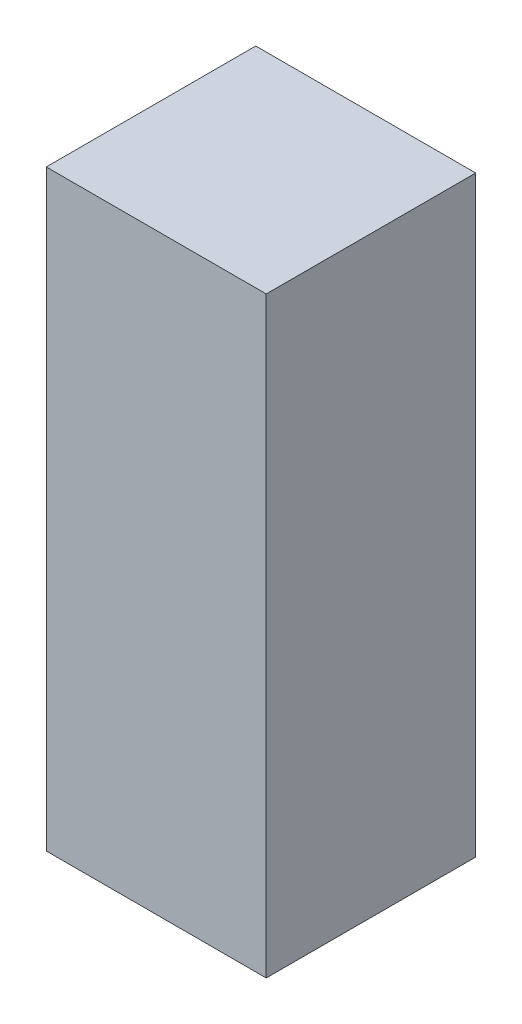
ISO-10303-21;
HEADER;
FILE_DESCRIPTION(('STEP AP214'),'2;1');
FILE_NAME('part.step','',(''),(''),'','','');
FILE_SCHEMA(('AUTOMOTIVE_DESIGN { 1 0 10303 214 1 1 1 1 }'));
ENDSEC;
DATA;
#1=APPLICATION_CONTEXT('core data for automotive mechanical design processes');
#2=APPLICATION_PROTOCOL_DEFINITION('international standard','automotive_design',2000,#1);
#3=PRODUCT_CONTEXT('',#1,'mechanical');
#4=PRODUCT('Part','Part','',(#3));
#5=PRODUCT_RELATED_PRODUCT_CATEGORY('part','',(#4));
#6=PRODUCT_DEFINITION_FORMATION('','',#4);
#7=PRODUCT_DEFINITION_CONTEXT('part definition',#1,'design');
#8=PRODUCT_DEFINITION('design','',#6,#7);
#9=PRODUCT_DEFINITION_SHAPE('','',#8);
#10=(LENGTH_UNIT() NAMED_UNIT(*) SI_UNIT(.MILLI.,.METRE.));
#11=(NAMED_UNIT(*) PLANE_ANGLE_UNIT() SI_UNIT($,.RADIAN.));
#12=(NAMED_UNIT(*) SI_UNIT($,.STERADIAN.) SOLID_ANGLE_UNIT());
#13=UNCERTAINTY_MEASURE_WITH_UNIT(LENGTH_MEASURE(1.E-05),#10,'distance_accuracy_value','');
#14=(GEOMETRIC_REPRESENTATION_CONTEXT(3) GLOBAL_UNCERTAINTY_ASSIGNED_CONTEXT((#13)) GLOBAL_UNIT_ASSIGNED_CONTEXT((#10,
#11,#12)) REPRESENTATION_CONTEXT('',''));
#15=CARTESIAN_POINT('',(0.,0.,0.));
#16=DIRECTION('',(0.,0.,1.));
#17=DIRECTION('',(1.,0.,0.));
#18=AXIS2_PLACEMENT_3D('',#15,#16,#17);
#19=CARTESIAN_POINT('',(7.76,0.982232995284,-6.999));
#20=DIRECTION('',(1.,0.,0.));
#21=DIRECTION('',(0.,-1.,0.));
#22=AXIS2_PLACEMENT_3D('',#19,#20,#21);
#23=PLANE('',#22);
#24=DIRECTION('',(0.,1.,0.));
#25=VECTOR('',#24,1.);
#26=CARTESIAN_POINT('',(7.76,0.415616497642,-7.));
#27=LINE('',#26,#25);
#28=CARTESIAN_POINT('',(7.76,-0.15,-7.));
#29=VERTEX_POINT('',#28);
#30=CARTESIAN_POINT('',(7.76,0.981232995284,-7.));
#31=VERTEX_POINT('',#30);
#32=EDGE_CURVE('E69',#29,#31,#27,.T.);
#33=ORIENTED_EDGE('',*,*,#32,.F.);
#34=DIRECTION('',(0.,0.,1.));
#35=VECTOR('',#34,1.);
#36=CARTESIAN_POINT('',(7.76,-0.15,-7.2));
#37=LINE('',#36,#35);
#38=CARTESIAN_POINT('',(7.76,-0.15,-7.4));
#39=VERTEX_POINT('',#38);
#40=EDGE_CURVE('E56',#39,#29,#37,.T.);
#41=ORIENTED_EDGE('',*,*,#40,.F.);
#42=DIRECTION('',(0.,-1.,0.));
#43=VECTOR('',#42,1.);
#44=CARTESIAN_POINT('',(7.76,0.415616497642,-7.4));
#45=LINE('',#44,#43);
#46=CARTESIAN_POINT('',(7.76,0.981232995284,-7.4));
#47=VERTEX_POINT('',#46);
#48=EDGE_CURVE('E21',#47,#39,#45,.T.);
#49=ORIENTED_EDGE('',*,*,#48,.F.);
#50=DIRECTION('',(0.,0.,-1.));
#51=VECTOR('',#50,1.);
#52=CARTESIAN_POINT('',(7.76,0.981232995284,-7.2));
#53=LINE('',#52,#51);
#54=EDGE_CURVE('E82',#31,#47,#53,.T.);
#55=ORIENTED_EDGE('',*,*,#54,.F.);
#56=EDGE_LOOP('',(#33,#41,#49,#55));
#57=FACE_BOUND('',#56,.T.);
#58=ADVANCED_FACE('F17',(#57),#23,.T.);
#59=CARTESIAN_POINT('',(7.761,-0.151,-7.4));
#60=DIRECTION('',(0.,0.,-1.));
#61=DIRECTION('',(-1.,0.,0.));
#62=AXIS2_PLACEMENT_3D('',#59,#60,#61);
#63=PLANE('',#62);
#64=DIRECTION('',(1.,0.,0.));
#65=VECTOR('',#64,1.);
#66=CARTESIAN_POINT('',(7.55,-0.15,-7.4));
#67=LINE('',#66,#65);
#68=CARTESIAN_POINT('',(7.34,-0.15,-7.4));
#69=VERTEX_POINT('',#68);
#70=EDGE_CURVE('E62',#69,#39,#67,.T.);
#71=ORIENTED_EDGE('',*,*,#70,.F.);
#72=DIRECTION('',(0.,-1.,0.));
#73=VECTOR('',#72,1.);
#74=CARTESIAN_POINT('',(7.34,0.415616497642,-7.4));
#75=LINE('',#74,#73);
#76=CARTESIAN_POINT('',(7.34,0.981232995284,-7.4));
#77=VERTEX_POINT('',#76);
#78=EDGE_CURVE('E84',#77,#69,#75,.T.);
#79=ORIENTED_EDGE('',*,*,#78,.F.);
#80=DIRECTION('',(-1.,0.,0.));
#81=VECTOR('',#80,1.);
#82=CARTESIAN_POINT('',(7.55,0.981232995284,-7.4));
#83=LINE('',#82,#81);
#84=EDGE_CURVE('E65',#47,#77,#83,.T.);
#85=ORIENTED_EDGE('',*,*,#84,.F.);
#86=ORIENTED_EDGE('',*,*,#48,.T.);
#87=EDGE_LOOP('',(#71,#79,#85,#86));
#88=FACE_BOUND('',#87,.T.);
#89=ADVANCED_FACE('F61',(#88),#63,.T.);
#90=CARTESIAN_POINT('',(7.761,-0.15,-6.999));
#91=DIRECTION('',(0.,-1.,0.));
#92=DIRECTION('',(-1.,0.,0.));
#93=AXIS2_PLACEMENT_3D('',#90,#91,#92);
#94=PLANE('',#93);
#95=DIRECTION('',(1.,0.,0.));
#96=VECTOR('',#95,1.);
#97=CARTESIAN_POINT('',(7.55,-0.15,-7.));
#98=LINE('',#97,#96);
#99=CARTESIAN_POINT('',(7.34,-0.15,-7.));
#100=VERTEX_POINT('',#99);
#101=EDGE_CURVE('E71',#100,#29,#98,.T.);
#102=ORIENTED_EDGE('',*,*,#101,.F.);
#103=DIRECTION('',(0.,0.,1.));
#104=VECTOR('',#103,1.);
#105=CARTESIAN_POINT('',(7.34,-0.15,-7.2));
#106=LINE('',#105,#104);
#107=EDGE_CURVE('E75',#69,#100,#106,.T.);
#108=ORIENTED_EDGE('',*,*,#107,.F.);
#109=ORIENTED_EDGE('',*,*,#70,.T.);
#110=ORIENTED_EDGE('',*,*,#40,.T.);
#111=EDGE_LOOP('',(#102,#108,#109,#110));
#112=FACE_BOUND('',#111,.T.);
#113=ADVANCED_FACE('F73',(#112),#94,.T.);
#114=CARTESIAN_POINT('',(7.339,-0.151,-7.));
#115=DIRECTION('',(0.,0.,1.));
#116=DIRECTION('',(1.,0.,0.));
#117=AXIS2_PLACEMENT_3D('',#114,#115,#116);
#118=PLANE('',#117);
#119=ORIENTED_EDGE('',*,*,#32,.T.);
#120=DIRECTION('',(1.,0.,0.));
#121=VECTOR('',#120,1.);
#122=CARTESIAN_POINT('',(7.55,0.981232995284,-7.));
#123=LINE('',#122,#121);
#124=CARTESIAN_POINT('',(7.34,0.981232995284,-7.));
#125=VERTEX_POINT('',#124);
#126=EDGE_CURVE('E36',#125,#31,#123,.T.);
#127=ORIENTED_EDGE('',*,*,#126,.F.);
#128=DIRECTION('',(0.,1.,0.));
#129=VECTOR('',#128,1.);
#130=CARTESIAN_POINT('',(7.34,0.415616497642,-7.));
#131=LINE('',#130,#129);
#132=EDGE_CURVE('E27',#100,#125,#131,.T.);
#133=ORIENTED_EDGE('',*,*,#132,.F.);
#134=ORIENTED_EDGE('',*,*,#101,.T.);
#135=EDGE_LOOP('',(#119,#127,#133,#134));
#136=FACE_BOUND('',#135,.T.);
#137=ADVANCED_FACE('F89',(#136),#118,.T.);
#138=CARTESIAN_POINT('',(7.339,0.981232995284,-6.999));
#139=DIRECTION('',(0.,1.,0.));
#140=DIRECTION('',(1.,0.,0.));
#141=AXIS2_PLACEMENT_3D('',#138,#139,#140);
#142=PLANE('',#141);
#143=ORIENTED_EDGE('',*,*,#126,.T.);
#144=ORIENTED_EDGE('',*,*,#54,.T.);
#145=ORIENTED_EDGE('',*,*,#84,.T.);
#146=DIRECTION('',(0.,0.,-1.));
#147=VECTOR('',#146,1.);
#148=CARTESIAN_POINT('',(7.34,0.981232995284,-7.2));
#149=LINE('',#148,#147);
#150=EDGE_CURVE('E11',#125,#77,#149,.T.);
#151=ORIENTED_EDGE('',*,*,#150,.F.);
#152=EDGE_LOOP('',(#143,#144,#145,#151));
#153=FACE_BOUND('',#152,.T.);
#154=ADVANCED_FACE('F91',(#153),#142,.T.);
#155=CARTESIAN_POINT('',(7.34,-0.151,-6.999));
#156=DIRECTION('',(-1.,0.,0.));
#157=DIRECTION('',(0.,1.,0.));
#158=AXIS2_PLACEMENT_3D('',#155,#156,#157);
#159=PLANE('',#158);
#160=ORIENTED_EDGE('',*,*,#132,.T.);
#161=ORIENTED_EDGE('',*,*,#150,.T.);
#162=ORIENTED_EDGE('',*,*,#78,.T.);
#163=ORIENTED_EDGE('',*,*,#107,.T.);
#164=EDGE_LOOP('',(#160,#161,#162,#163));
#165=FACE_BOUND('',#164,.T.);
#166=ADVANCED_FACE('F19',(#165),#159,.T.);
#167=CLOSED_SHELL('',(#58,#89,#113,#137,#154,#166));
#168=MANIFOLD_SOLID_BREP('B1',#167);
#169=ADVANCED_BREP_SHAPE_REPRESENTATION('',(#18,#168),#14);
#170=SHAPE_DEFINITION_REPRESENTATION(#9,#169);
ENDSEC;
END-ISO-10303-21;
